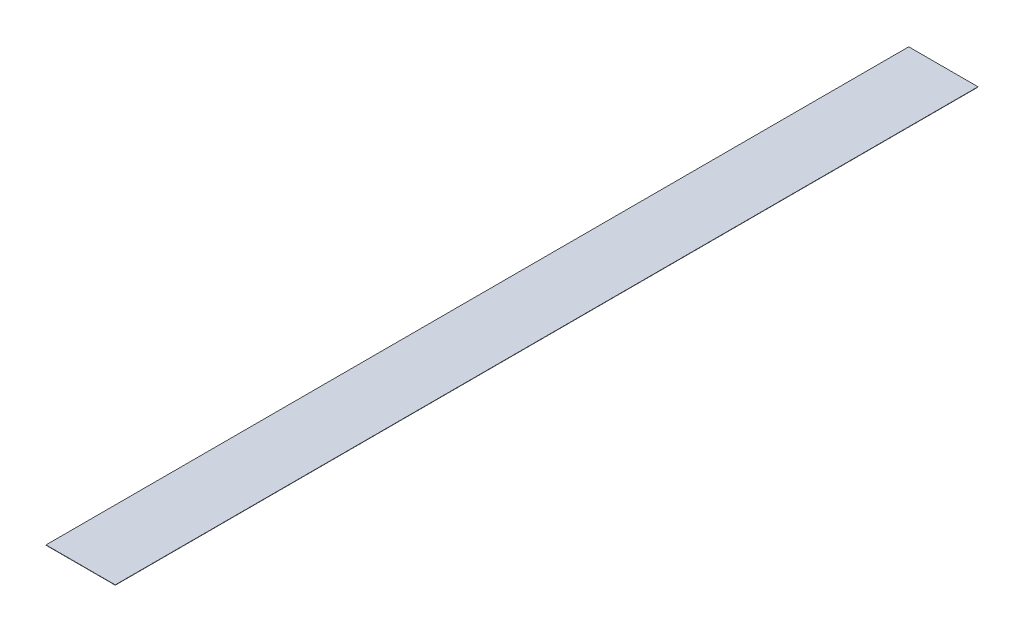
ISO-10303-21;
HEADER;
FILE_DESCRIPTION(('STEP AP214'),'2;1');
FILE_NAME('part.step','',(''),(''),'','','');
FILE_SCHEMA(('AUTOMOTIVE_DESIGN { 1 0 10303 214 1 1 1 1 }'));
ENDSEC;
DATA;
#1=APPLICATION_CONTEXT('core data for automotive mechanical design processes');
#2=APPLICATION_PROTOCOL_DEFINITION('international standard','automotive_design',2000,#1);
#3=PRODUCT_CONTEXT('',#1,'mechanical');
#4=PRODUCT('Part','Part','',(#3));
#5=PRODUCT_RELATED_PRODUCT_CATEGORY('part','',(#4));
#6=PRODUCT_DEFINITION_FORMATION('','',#4);
#7=PRODUCT_DEFINITION_CONTEXT('part definition',#1,'design');
#8=PRODUCT_DEFINITION('design','',#6,#7);
#9=PRODUCT_DEFINITION_SHAPE('','',#8);
#10=(LENGTH_UNIT() NAMED_UNIT(*) SI_UNIT(.MILLI.,.METRE.));
#11=(NAMED_UNIT(*) PLANE_ANGLE_UNIT() SI_UNIT($,.RADIAN.));
#12=(NAMED_UNIT(*) SI_UNIT($,.STERADIAN.) SOLID_ANGLE_UNIT());
#13=UNCERTAINTY_MEASURE_WITH_UNIT(LENGTH_MEASURE(1.E-05),#10,'distance_accuracy_value','');
#14=(GEOMETRIC_REPRESENTATION_CONTEXT(3) GLOBAL_UNCERTAINTY_ASSIGNED_CONTEXT((#13)) GLOBAL_UNIT_ASSIGNED_CONTEXT((#10,
#11,#12)) REPRESENTATION_CONTEXT('',''));
#15=CARTESIAN_POINT('',(0.,0.,0.));
#16=DIRECTION('',(0.,0.,1.));
#17=DIRECTION('',(1.,0.,0.));
#18=AXIS2_PLACEMENT_3D('',#15,#16,#17);
#19=CARTESIAN_POINT('',(-12.3027,0.1,-153.25));
#20=DIRECTION('',(1.,0.,0.));
#21=DIRECTION('',(0.,0.,-1.));
#22=AXIS2_PLACEMENT_3D('',#19,#20,#21);
#23=PLANE('',#22);
#24=DIRECTION('',(0.,0.,1.));
#25=VECTOR('',#24,1.);
#26=CARTESIAN_POINT('',(-12.3027,0.,-153.25));
#27=LINE('',#26,#25);
#28=CARTESIAN_POINT('',(-12.3027,0.,-153.25));
#29=VERTEX_POINT('',#28);
#30=CARTESIAN_POINT('',(-12.3027,0.,153.25));
#31=VERTEX_POINT('',#30);
#32=EDGE_CURVE('E96',#29,#31,#27,.T.);
#33=ORIENTED_EDGE('',*,*,#32,.T.);
#34=DIRECTION('',(0.,-1.,0.));
#35=VECTOR('',#34,1.);
#36=CARTESIAN_POINT('',(-12.3027,0.1,153.25));
#37=LINE('',#36,#35);
#38=CARTESIAN_POINT('',(-12.3027,0.1,153.25));
#39=VERTEX_POINT('',#38);
#40=EDGE_CURVE('E11',#39,#31,#37,.T.);
#41=ORIENTED_EDGE('',*,*,#40,.F.);
#42=DIRECTION('',(0.,0.,1.));
#43=VECTOR('',#42,1.);
#44=CARTESIAN_POINT('',(-12.3027,0.1,-153.25));
#45=LINE('',#44,#43);
#46=CARTESIAN_POINT('',(-12.3027,0.1,-153.25));
#47=VERTEX_POINT('',#46);
#48=EDGE_CURVE('E84',#47,#39,#45,.T.);
#49=ORIENTED_EDGE('',*,*,#48,.F.);
#50=DIRECTION('',(0.,-1.,0.));
#51=VECTOR('',#50,1.);
#52=CARTESIAN_POINT('',(-12.3027,0.1,-153.25));
#53=LINE('',#52,#51);
#54=EDGE_CURVE('E92',#47,#29,#53,.T.);
#55=ORIENTED_EDGE('',*,*,#54,.T.);
#56=EDGE_LOOP('',(#33,#41,#49,#55));
#57=FACE_BOUND('',#56,.T.);
#58=ADVANCED_FACE('F33',(#57),#23,.F.);
#59=CARTESIAN_POINT('',(-12.3027,0.1,153.25));
#60=DIRECTION('',(0.,0.,-1.));
#61=DIRECTION('',(-1.,0.,0.));
#62=AXIS2_PLACEMENT_3D('',#59,#60,#61);
#63=PLANE('',#62);
#64=DIRECTION('',(1.,0.,0.));
#65=VECTOR('',#64,1.);
#66=CARTESIAN_POINT('',(-12.3027,0.,153.25));
#67=LINE('',#66,#65);
#68=CARTESIAN_POINT('',(12.3027,0.,153.25));
#69=VERTEX_POINT('',#68);
#70=EDGE_CURVE('E88',#31,#69,#67,.T.);
#71=ORIENTED_EDGE('',*,*,#70,.T.);
#72=DIRECTION('',(0.,-1.,0.));
#73=VECTOR('',#72,1.);
#74=CARTESIAN_POINT('',(12.3027,0.1,153.25));
#75=LINE('',#74,#73);
#76=CARTESIAN_POINT('',(12.3027,0.1,153.25));
#77=VERTEX_POINT('',#76);
#78=EDGE_CURVE('E41',#77,#69,#75,.T.);
#79=ORIENTED_EDGE('',*,*,#78,.F.);
#80=DIRECTION('',(1.,0.,0.));
#81=VECTOR('',#80,1.);
#82=CARTESIAN_POINT('',(-12.3027,0.1,153.25));
#83=LINE('',#82,#81);
#84=EDGE_CURVE('E79',#39,#77,#83,.T.);
#85=ORIENTED_EDGE('',*,*,#84,.F.);
#86=ORIENTED_EDGE('',*,*,#40,.T.);
#87=EDGE_LOOP('',(#71,#79,#85,#86));
#88=FACE_BOUND('',#87,.T.);
#89=ADVANCED_FACE('F87',(#88),#63,.F.);
#90=CARTESIAN_POINT('',(12.3027,0.1,-153.25));
#91=DIRECTION('',(-1.,0.,0.));
#92=DIRECTION('',(0.,0.,1.));
#93=AXIS2_PLACEMENT_3D('',#90,#91,#92);
#94=PLANE('',#93);
#95=DIRECTION('',(0.,0.,-1.));
#96=VECTOR('',#95,1.);
#97=CARTESIAN_POINT('',(12.3027,0.,-153.25));
#98=LINE('',#97,#96);
#99=CARTESIAN_POINT('',(12.3027,0.,-153.25));
#100=VERTEX_POINT('',#99);
#101=EDGE_CURVE('E66',#69,#100,#98,.T.);
#102=ORIENTED_EDGE('',*,*,#101,.T.);
#103=DIRECTION('',(0.,-1.,0.));
#104=VECTOR('',#103,1.);
#105=CARTESIAN_POINT('',(12.3027,0.1,-153.25));
#106=LINE('',#105,#104);
#107=CARTESIAN_POINT('',(12.3027,0.1,-153.25));
#108=VERTEX_POINT('',#107);
#109=EDGE_CURVE('E89',#108,#100,#106,.T.);
#110=ORIENTED_EDGE('',*,*,#109,.F.);
#111=DIRECTION('',(0.,0.,-1.));
#112=VECTOR('',#111,1.);
#113=CARTESIAN_POINT('',(12.3027,0.1,-153.25));
#114=LINE('',#113,#112);
#115=EDGE_CURVE('E82',#77,#108,#114,.T.);
#116=ORIENTED_EDGE('',*,*,#115,.F.);
#117=ORIENTED_EDGE('',*,*,#78,.T.);
#118=EDGE_LOOP('',(#102,#110,#116,#117));
#119=FACE_BOUND('',#118,.T.);
#120=ADVANCED_FACE('F90',(#119),#94,.F.);
#121=CARTESIAN_POINT('',(-12.3027,0.1,-153.25));
#122=DIRECTION('',(0.,0.,1.));
#123=DIRECTION('',(1.,0.,0.));
#124=AXIS2_PLACEMENT_3D('',#121,#122,#123);
#125=PLANE('',#124);
#126=DIRECTION('',(-1.,0.,0.));
#127=VECTOR('',#126,1.);
#128=CARTESIAN_POINT('',(-12.3027,0.,-153.25));
#129=LINE('',#128,#127);
#130=EDGE_CURVE('E72',#100,#29,#129,.T.);
#131=ORIENTED_EDGE('',*,*,#130,.T.);
#132=ORIENTED_EDGE('',*,*,#54,.F.);
#133=DIRECTION('',(-1.,0.,0.));
#134=VECTOR('',#133,1.);
#135=CARTESIAN_POINT('',(-12.3027,0.1,-153.25));
#136=LINE('',#135,#134);
#137=EDGE_CURVE('E49',#108,#47,#136,.T.);
#138=ORIENTED_EDGE('',*,*,#137,.F.);
#139=ORIENTED_EDGE('',*,*,#109,.T.);
#140=EDGE_LOOP('',(#131,#132,#138,#139));
#141=FACE_BOUND('',#140,.T.);
#142=ADVANCED_FACE('F103',(#141),#125,.F.);
#143=CARTESIAN_POINT('',(-12.3027,0.1,153.25));
#144=DIRECTION('',(0.,1.,0.));
#145=DIRECTION('',(0.,0.,1.));
#146=AXIS2_PLACEMENT_3D('',#143,#144,#145);
#147=PLANE('',#146);
#148=ORIENTED_EDGE('',*,*,#48,.T.);
#149=ORIENTED_EDGE('',*,*,#84,.T.);
#150=ORIENTED_EDGE('',*,*,#115,.T.);
#151=ORIENTED_EDGE('',*,*,#137,.T.);
#152=EDGE_LOOP('',(#148,#149,#150,#151));
#153=FACE_BOUND('',#152,.T.);
#154=ADVANCED_FACE('F80',(#153),#147,.T.);
#155=CARTESIAN_POINT('',(-12.3027,0.,153.25));
#156=DIRECTION('',(0.,1.,0.));
#157=DIRECTION('',(0.,0.,1.));
#158=AXIS2_PLACEMENT_3D('',#155,#156,#157);
#159=PLANE('',#158);
#160=ORIENTED_EDGE('',*,*,#32,.F.);
#161=ORIENTED_EDGE('',*,*,#130,.F.);
#162=ORIENTED_EDGE('',*,*,#101,.F.);
#163=ORIENTED_EDGE('',*,*,#70,.F.);
#164=EDGE_LOOP('',(#160,#161,#162,#163));
#165=FACE_BOUND('',#164,.T.);
#166=ADVANCED_FACE('F106',(#165),#159,.F.);
#167=CLOSED_SHELL('',(#58,#89,#120,#142,#154,#166));
#168=MANIFOLD_SOLID_BREP('B2',#167);
#169=ADVANCED_BREP_SHAPE_REPRESENTATION('',(#18,#168),#14);
#170=SHAPE_DEFINITION_REPRESENTATION(#9,#169);
ENDSEC;
END-ISO-10303-21;
